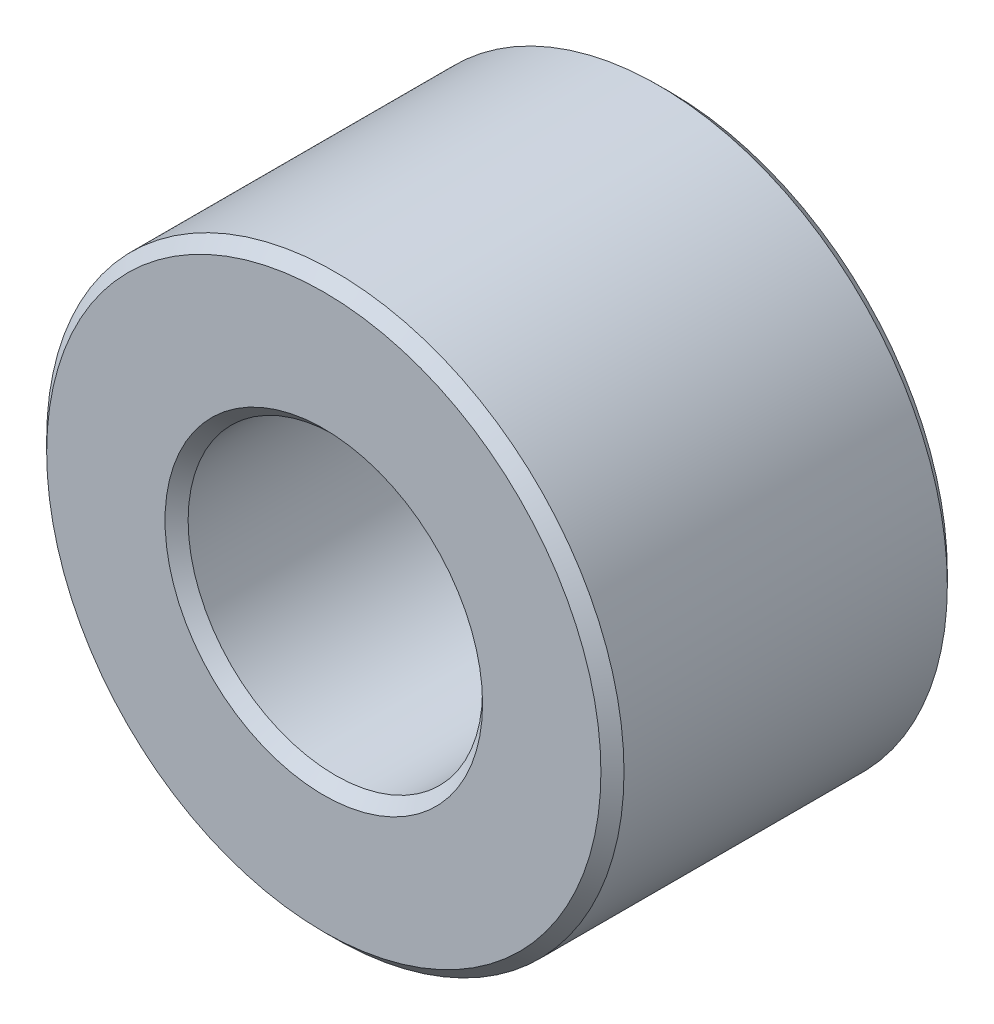
ISO-10303-21;
HEADER;
FILE_DESCRIPTION(('STEP AP214'),'2;1');
FILE_NAME('part.step','',(''),(''),'','','');
FILE_SCHEMA(('AUTOMOTIVE_DESIGN { 1 0 10303 214 1 1 1 1 }'));
ENDSEC;
DATA;
#1=APPLICATION_CONTEXT('core data for automotive mechanical design processes');
#2=APPLICATION_PROTOCOL_DEFINITION('international standard','automotive_design',2000,#1);
#3=PRODUCT_CONTEXT('',#1,'mechanical');
#4=PRODUCT('Part','Part','',(#3));
#5=PRODUCT_RELATED_PRODUCT_CATEGORY('part','',(#4));
#6=PRODUCT_DEFINITION_FORMATION('','',#4);
#7=PRODUCT_DEFINITION_CONTEXT('part definition',#1,'design');
#8=PRODUCT_DEFINITION('design','',#6,#7);
#9=PRODUCT_DEFINITION_SHAPE('','',#8);
#10=(LENGTH_UNIT() NAMED_UNIT(*) SI_UNIT(.MILLI.,.METRE.));
#11=(NAMED_UNIT(*) PLANE_ANGLE_UNIT() SI_UNIT($,.RADIAN.));
#12=(NAMED_UNIT(*) SI_UNIT($,.STERADIAN.) SOLID_ANGLE_UNIT());
#13=UNCERTAINTY_MEASURE_WITH_UNIT(LENGTH_MEASURE(1.E-05),#10,'distance_accuracy_value','');
#14=(GEOMETRIC_REPRESENTATION_CONTEXT(3) GLOBAL_UNCERTAINTY_ASSIGNED_CONTEXT((#13)) GLOBAL_UNIT_ASSIGNED_CONTEXT((#10,
#11,#12)) REPRESENTATION_CONTEXT('',''));
#15=CARTESIAN_POINT('',(0.,0.,0.));
#16=DIRECTION('',(0.,0.,1.));
#17=DIRECTION('',(1.,0.,0.));
#18=AXIS2_PLACEMENT_3D('',#15,#16,#17);
#19=CARTESIAN_POINT('',(0.,0.,5.99999999999978));
#20=DIRECTION('',(0.,0.,1.));
#21=DIRECTION('',(0.999999999999995,0.,0.));
#22=AXIS2_PLACEMENT_3D('',#19,#20,#21);
#23=PLANE('',#22);
#24=CARTESIAN_POINT('',(0.,0.,5.99999999999978));
#25=DIRECTION('',(0.,0.,1.));
#26=DIRECTION('',(0.999999999999995,0.,0.));
#27=AXIS2_PLACEMENT_3D('',#24,#25,#26);
#28=CIRCLE('',#27,2.75);
#29=CARTESIAN_POINT('',(2.74999999999999,0.,5.99999999999978));
#30=VERTEX_POINT('',#29);
#31=EDGE_CURVE('E12',#30,#30,#28,.F.);
#32=ORIENTED_EDGE('',*,*,#31,.T.);
#33=EDGE_LOOP('',(#32));
#34=FACE_BOUND('',#33,.T.);
#35=CARTESIAN_POINT('',(0.,0.,5.99999999999978));
#36=DIRECTION('',(0.,0.,1.));
#37=DIRECTION('',(0.999999999999995,0.,0.));
#38=AXIS2_PLACEMENT_3D('',#35,#36,#37);
#39=CIRCLE('',#38,4.8);
#40=CARTESIAN_POINT('',(4.79999999999998,0.,5.99999999999978));
#41=VERTEX_POINT('',#40);
#42=EDGE_CURVE('E53',#41,#41,#39,.T.);
#43=ORIENTED_EDGE('',*,*,#42,.T.);
#44=EDGE_LOOP('',(#43));
#45=FACE_BOUND('',#44,.T.);
#46=ADVANCED_FACE('F46',(#34,#45),#23,.T.);
#47=CARTESIAN_POINT('',(0.,0.,0.));
#48=DIRECTION('',(0.,0.,1.));
#49=DIRECTION('',(0.999999999999995,0.,0.));
#50=AXIS2_PLACEMENT_3D('',#47,#48,#49);
#51=PLANE('',#50);
#52=CARTESIAN_POINT('',(0.,0.,0.));
#53=DIRECTION('',(0.,0.,1.));
#54=DIRECTION('',(0.999999999999995,0.,0.));
#55=AXIS2_PLACEMENT_3D('',#52,#53,#54);
#56=CIRCLE('',#55,4.8);
#57=CARTESIAN_POINT('',(4.79999999999998,0.,0.));
#58=VERTEX_POINT('',#57);
#59=EDGE_CURVE('E66',#58,#58,#56,.F.);
#60=ORIENTED_EDGE('',*,*,#59,.T.);
#61=EDGE_LOOP('',(#60));
#62=FACE_BOUND('',#61,.T.);
#63=CARTESIAN_POINT('',(0.,0.,0.));
#64=DIRECTION('',(0.,0.,1.));
#65=DIRECTION('',(0.999999999999995,0.,0.));
#66=AXIS2_PLACEMENT_3D('',#63,#64,#65);
#67=CIRCLE('',#66,2.75);
#68=CARTESIAN_POINT('',(2.74999999999999,0.,0.));
#69=VERTEX_POINT('',#68);
#70=EDGE_CURVE('E69',#69,#69,#67,.T.);
#71=ORIENTED_EDGE('',*,*,#70,.T.);
#72=EDGE_LOOP('',(#71));
#73=FACE_BOUND('',#72,.T.);
#74=ADVANCED_FACE('F90',(#62,#73),#51,.F.);
#75=CARTESIAN_POINT('',(0.,0.,5.99999999999978));
#76=DIRECTION('',(0.,0.,-1.));
#77=DIRECTION('',(-0.999999999999995,0.,0.));
#78=AXIS2_PLACEMENT_3D('',#75,#76,#77);
#79=CYLINDRICAL_SURFACE('',#78,5.);
#80=CARTESIAN_POINT('',(0.,0.,0.199999999999978));
#81=DIRECTION('',(0.,0.,1.));
#82=DIRECTION('',(0.999999999999995,0.,0.));
#83=AXIS2_PLACEMENT_3D('',#80,#81,#82);
#84=CIRCLE('',#83,5.);
#85=CARTESIAN_POINT('',(4.99999999999998,0.,0.199999999999978));
#86=VERTEX_POINT('',#85);
#87=EDGE_CURVE('E72',#86,#86,#84,.T.);
#88=ORIENTED_EDGE('',*,*,#87,.T.);
#89=EDGE_LOOP('',(#88));
#90=FACE_BOUND('',#89,.T.);
#91=CARTESIAN_POINT('',(0.,0.,5.79999999999981));
#92=DIRECTION('',(0.,0.,1.));
#93=DIRECTION('',(0.999999999999995,0.,0.));
#94=AXIS2_PLACEMENT_3D('',#91,#92,#93);
#95=CIRCLE('',#94,5.);
#96=CARTESIAN_POINT('',(4.99999999999998,0.,5.79999999999981));
#97=VERTEX_POINT('',#96);
#98=EDGE_CURVE('E75',#97,#97,#95,.F.);
#99=ORIENTED_EDGE('',*,*,#98,.T.);
#100=EDGE_LOOP('',(#99));
#101=FACE_BOUND('',#100,.T.);
#102=ADVANCED_FACE('F79',(#90,#101),#79,.T.);
#103=CARTESIAN_POINT('',(0.,0.,5.99999999999978));
#104=DIRECTION('',(0.,0.,-1.));
#105=DIRECTION('',(-0.999999999999995,0.,0.));
#106=AXIS2_PLACEMENT_3D('',#103,#104,#105);
#107=CYLINDRICAL_SURFACE('',#106,2.55);
#108=CARTESIAN_POINT('',(0.,0.,0.199999999999978));
#109=DIRECTION('',(0.,0.,1.));
#110=DIRECTION('',(0.999999999999995,0.,0.));
#111=AXIS2_PLACEMENT_3D('',#108,#109,#110);
#112=CIRCLE('',#111,2.55);
#113=CARTESIAN_POINT('',(2.54999999999999,0.,0.199999999999978));
#114=VERTEX_POINT('',#113);
#115=EDGE_CURVE('E57',#114,#114,#112,.F.);
#116=ORIENTED_EDGE('',*,*,#115,.T.);
#117=EDGE_LOOP('',(#116));
#118=FACE_BOUND('',#117,.T.);
#119=CARTESIAN_POINT('',(0.,0.,5.79999999999981));
#120=DIRECTION('',(0.,0.,1.));
#121=DIRECTION('',(0.999999999999995,0.,0.));
#122=AXIS2_PLACEMENT_3D('',#119,#120,#121);
#123=CIRCLE('',#122,2.55);
#124=CARTESIAN_POINT('',(2.54999999999999,0.,5.79999999999981));
#125=VERTEX_POINT('',#124);
#126=EDGE_CURVE('E61',#125,#125,#123,.T.);
#127=ORIENTED_EDGE('',*,*,#126,.T.);
#128=EDGE_LOOP('',(#127));
#129=FACE_BOUND('',#128,.T.);
#130=ADVANCED_FACE('F98',(#118,#129),#107,.F.);
#131=CARTESIAN_POINT('',(0.,0.,0.199999999999978));
#132=DIRECTION('',(0.,0.,1.));
#133=DIRECTION('',(0.999999999999995,0.,0.));
#134=AXIS2_PLACEMENT_3D('',#131,#132,#133);
#135=CONICAL_SURFACE('',#134,5.,0.785398163397455);
#136=ORIENTED_EDGE('',*,*,#59,.F.);
#137=EDGE_LOOP('',(#136));
#138=FACE_BOUND('',#137,.T.);
#139=ORIENTED_EDGE('',*,*,#87,.F.);
#140=EDGE_LOOP('',(#139));
#141=FACE_BOUND('',#140,.T.);
#142=ADVANCED_FACE('F103',(#138,#141),#135,.T.);
#143=CARTESIAN_POINT('',(0.,0.,0.));
#144=DIRECTION('',(0.,0.,-1.));
#145=DIRECTION('',(-0.999999999999995,0.,0.));
#146=AXIS2_PLACEMENT_3D('',#143,#144,#145);
#147=CONICAL_SURFACE('',#146,2.75,0.785398163397443);
#148=ORIENTED_EDGE('',*,*,#115,.F.);
#149=EDGE_LOOP('',(#148));
#150=FACE_BOUND('',#149,.T.);
#151=ORIENTED_EDGE('',*,*,#70,.F.);
#152=EDGE_LOOP('',(#151));
#153=FACE_BOUND('',#152,.T.);
#154=ADVANCED_FACE('F87',(#150,#153),#147,.F.);
#155=CARTESIAN_POINT('',(0.,0.,5.79999999999981));
#156=DIRECTION('',(0.,0.,1.));
#157=DIRECTION('',(0.999999999999995,0.,0.));
#158=AXIS2_PLACEMENT_3D('',#155,#156,#157);
#159=CONICAL_SURFACE('',#158,2.55,0.785398163397454);
#160=ORIENTED_EDGE('',*,*,#31,.F.);
#161=EDGE_LOOP('',(#160));
#162=FACE_BOUND('',#161,.T.);
#163=ORIENTED_EDGE('',*,*,#126,.F.);
#164=EDGE_LOOP('',(#163));
#165=FACE_BOUND('',#164,.T.);
#166=ADVANCED_FACE('F83',(#162,#165),#159,.F.);
#167=CARTESIAN_POINT('',(0.,0.,5.99999999999978));
#168=DIRECTION('',(0.,0.,-1.));
#169=DIRECTION('',(-0.999999999999995,0.,0.));
#170=AXIS2_PLACEMENT_3D('',#167,#168,#169);
#171=CONICAL_SURFACE('',#170,4.8,0.785398163397448);
#172=ORIENTED_EDGE('',*,*,#98,.F.);
#173=EDGE_LOOP('',(#172));
#174=FACE_BOUND('',#173,.T.);
#175=ORIENTED_EDGE('',*,*,#42,.F.);
#176=EDGE_LOOP('',(#175));
#177=FACE_BOUND('',#176,.T.);
#178=ADVANCED_FACE('F48',(#174,#177),#171,.T.);
#179=CLOSED_SHELL('',(#46,#74,#102,#130,#142,#154,#166,#178));
#180=MANIFOLD_SOLID_BREP('B2',#179);
#181=ADVANCED_BREP_SHAPE_REPRESENTATION('',(#18,#180),#14);
#182=SHAPE_DEFINITION_REPRESENTATION(#9,#181);
ENDSEC;
END-ISO-10303-21;
